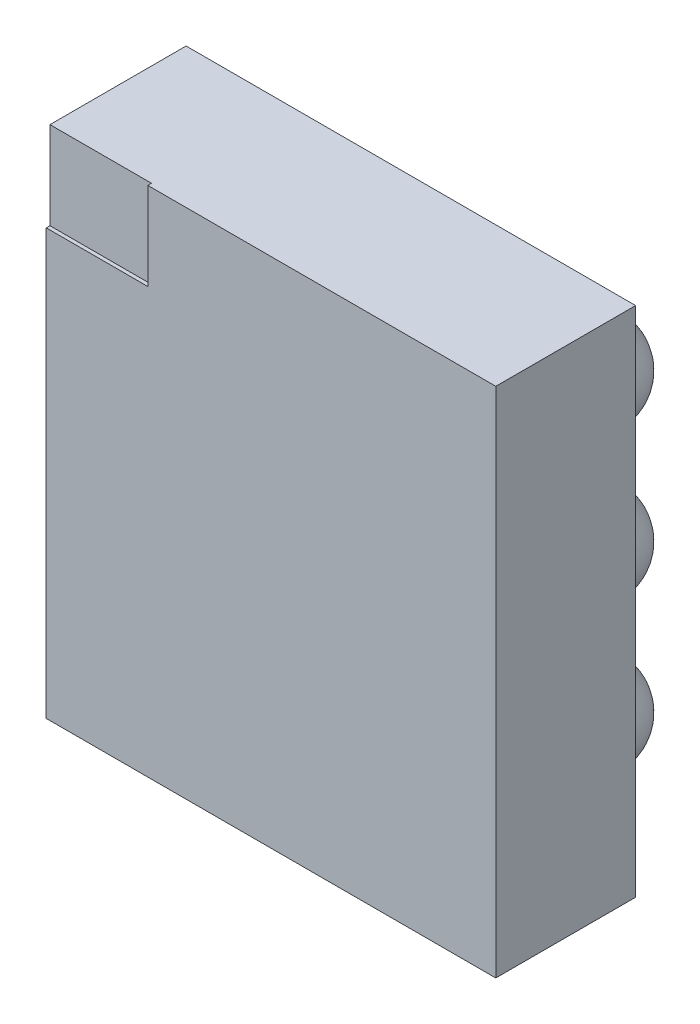
ISO-10303-21;
HEADER;
FILE_DESCRIPTION(('STEP AP214'),'2;1');
FILE_NAME('part.step','',(''),(''),'','','');
FILE_SCHEMA(('AUTOMOTIVE_DESIGN { 1 0 10303 214 1 1 1 1 }'));
ENDSEC;
DATA;
#1=APPLICATION_CONTEXT('core data for automotive mechanical design processes');
#2=APPLICATION_PROTOCOL_DEFINITION('international standard','automotive_design',2000,#1);
#3=PRODUCT_CONTEXT('',#1,'mechanical');
#4=PRODUCT('Part','Part','',(#3));
#5=PRODUCT_RELATED_PRODUCT_CATEGORY('part','',(#4));
#6=PRODUCT_DEFINITION_FORMATION('','',#4);
#7=PRODUCT_DEFINITION_CONTEXT('part definition',#1,'design');
#8=PRODUCT_DEFINITION('design','',#6,#7);
#9=PRODUCT_DEFINITION_SHAPE('','',#8);
#10=(LENGTH_UNIT() NAMED_UNIT(*) SI_UNIT(.MILLI.,.METRE.));
#11=(NAMED_UNIT(*) PLANE_ANGLE_UNIT() SI_UNIT($,.RADIAN.));
#12=(NAMED_UNIT(*) SI_UNIT($,.STERADIAN.) SOLID_ANGLE_UNIT());
#13=UNCERTAINTY_MEASURE_WITH_UNIT(LENGTH_MEASURE(1.E-05),#10,'distance_accuracy_value','');
#14=(GEOMETRIC_REPRESENTATION_CONTEXT(3) GLOBAL_UNCERTAINTY_ASSIGNED_CONTEXT((#13)) GLOBAL_UNIT_ASSIGNED_CONTEXT((#10,
#11,#12)) REPRESENTATION_CONTEXT('',''));
#15=CARTESIAN_POINT('',(0.,0.,0.));
#16=DIRECTION('',(0.,0.,1.));
#17=DIRECTION('',(1.,0.,0.));
#18=AXIS2_PLACEMENT_3D('',#15,#16,#17);
#19=CARTESIAN_POINT('',(0.4,-0.4,0.13));
#20=DIRECTION('',(0.,0.,1.));
#21=DIRECTION('',(0.,-1.,0.));
#22=AXIS2_PLACEMENT_3D('',#19,#20,#21);
#23=SPHERICAL_SURFACE('',#22,0.13);
#24=CARTESIAN_POINT('',(0.4,-0.4,0.203));
#25=DIRECTION('',(0.,0.,-1.));
#26=DIRECTION('',(-1.,0.,0.));
#27=AXIS2_PLACEMENT_3D('',#24,#25,#26);
#28=CIRCLE('',#27,0.107568582773968);
#29=CARTESIAN_POINT('',(0.292431417226032,-0.4,0.203));
#30=VERTEX_POINT('',#29);
#31=EDGE_CURVE('E11',#30,#30,#28,.T.);
#32=ORIENTED_EDGE('',*,*,#31,.T.);
#33=EDGE_LOOP('',(#32));
#34=FACE_BOUND('',#33,.T.);
#35=ADVANCED_FACE('F39',(#34),#23,.T.);
#36=CARTESIAN_POINT('',(0.,-0.4,0.13));
#37=DIRECTION('',(0.,0.,1.));
#38=DIRECTION('',(0.,-1.,0.));
#39=AXIS2_PLACEMENT_3D('',#36,#37,#38);
#40=SPHERICAL_SURFACE('',#39,0.13);
#41=CARTESIAN_POINT('',(0.,-0.4,0.203));
#42=DIRECTION('',(0.,0.,-1.));
#43=DIRECTION('',(-1.,0.,0.));
#44=AXIS2_PLACEMENT_3D('',#41,#42,#43);
#45=CIRCLE('',#44,0.107568582773968);
#46=CARTESIAN_POINT('',(-0.107568582773968,-0.4,0.203));
#47=VERTEX_POINT('',#46);
#48=EDGE_CURVE('E46',#47,#47,#45,.T.);
#49=ORIENTED_EDGE('',*,*,#48,.T.);
#50=EDGE_LOOP('',(#49));
#51=FACE_BOUND('',#50,.T.);
#52=ADVANCED_FACE('F180',(#51),#40,.T.);
#53=CARTESIAN_POINT('',(-0.4,-0.4,0.13));
#54=DIRECTION('',(0.,0.,1.));
#55=DIRECTION('',(0.,-1.,0.));
#56=AXIS2_PLACEMENT_3D('',#53,#54,#55);
#57=SPHERICAL_SURFACE('',#56,0.13);
#58=CARTESIAN_POINT('',(-0.4,-0.4,0.203));
#59=DIRECTION('',(0.,0.,-1.));
#60=DIRECTION('',(-1.,0.,0.));
#61=AXIS2_PLACEMENT_3D('',#58,#59,#60);
#62=CIRCLE('',#61,0.107568582773968);
#63=CARTESIAN_POINT('',(-0.507568582773968,-0.4,0.203));
#64=VERTEX_POINT('',#63);
#65=EDGE_CURVE('E175',#64,#64,#62,.T.);
#66=ORIENTED_EDGE('',*,*,#65,.T.);
#67=EDGE_LOOP('',(#66));
#68=FACE_BOUND('',#67,.T.);
#69=ADVANCED_FACE('F225',(#68),#57,.T.);
#70=CARTESIAN_POINT('',(0.4,0.,0.13));
#71=DIRECTION('',(0.,0.,1.));
#72=DIRECTION('',(0.,-1.,0.));
#73=AXIS2_PLACEMENT_3D('',#70,#71,#72);
#74=SPHERICAL_SURFACE('',#73,0.13);
#75=CARTESIAN_POINT('',(0.4,0.,0.203));
#76=DIRECTION('',(0.,0.,-1.));
#77=DIRECTION('',(-1.,0.,0.));
#78=AXIS2_PLACEMENT_3D('',#75,#76,#77);
#79=CIRCLE('',#78,0.107568582773968);
#80=CARTESIAN_POINT('',(0.292431417226032,0.,0.203));
#81=VERTEX_POINT('',#80);
#82=EDGE_CURVE('E172',#81,#81,#79,.T.);
#83=ORIENTED_EDGE('',*,*,#82,.T.);
#84=EDGE_LOOP('',(#83));
#85=FACE_BOUND('',#84,.T.);
#86=ADVANCED_FACE('F230',(#85),#74,.T.);
#87=CARTESIAN_POINT('',(0.4,0.4,0.13));
#88=DIRECTION('',(0.,0.,1.));
#89=DIRECTION('',(0.,-1.,0.));
#90=AXIS2_PLACEMENT_3D('',#87,#88,#89);
#91=SPHERICAL_SURFACE('',#90,0.13);
#92=CARTESIAN_POINT('',(0.4,0.4,0.203));
#93=DIRECTION('',(0.,0.,-1.));
#94=DIRECTION('',(-1.,0.,0.));
#95=AXIS2_PLACEMENT_3D('',#92,#93,#94);
#96=CIRCLE('',#95,0.107568582773968);
#97=CARTESIAN_POINT('',(0.292431417226032,0.4,0.203));
#98=VERTEX_POINT('',#97);
#99=EDGE_CURVE('E169',#98,#98,#96,.T.);
#100=ORIENTED_EDGE('',*,*,#99,.T.);
#101=EDGE_LOOP('',(#100));
#102=FACE_BOUND('',#101,.T.);
#103=ADVANCED_FACE('F236',(#102),#91,.T.);
#104=CARTESIAN_POINT('',(-0.4,0.4,0.13));
#105=DIRECTION('',(0.,0.,1.));
#106=DIRECTION('',(0.,-1.,0.));
#107=AXIS2_PLACEMENT_3D('',#104,#105,#106);
#108=SPHERICAL_SURFACE('',#107,0.13);
#109=CARTESIAN_POINT('',(-0.4,0.4,0.203));
#110=DIRECTION('',(0.,0.,-1.));
#111=DIRECTION('',(-1.,0.,0.));
#112=AXIS2_PLACEMENT_3D('',#109,#110,#111);
#113=CIRCLE('',#112,0.107568582773968);
#114=CARTESIAN_POINT('',(-0.507568582773968,0.4,0.203));
#115=VERTEX_POINT('',#114);
#116=EDGE_CURVE('E166',#115,#115,#113,.T.);
#117=ORIENTED_EDGE('',*,*,#116,.T.);
#118=EDGE_LOOP('',(#117));
#119=FACE_BOUND('',#118,.T.);
#120=ADVANCED_FACE('F240',(#119),#108,.T.);
#121=CARTESIAN_POINT('',(-0.4,0.,0.13));
#122=DIRECTION('',(0.,0.,1.));
#123=DIRECTION('',(0.,-1.,0.));
#124=AXIS2_PLACEMENT_3D('',#121,#122,#123);
#125=SPHERICAL_SURFACE('',#124,0.13);
#126=CARTESIAN_POINT('',(-0.4,0.,0.203));
#127=DIRECTION('',(0.,0.,-1.));
#128=DIRECTION('',(-1.,0.,0.));
#129=AXIS2_PLACEMENT_3D('',#126,#127,#128);
#130=CIRCLE('',#129,0.107568582773968);
#131=CARTESIAN_POINT('',(-0.507568582773968,0.,0.203));
#132=VERTEX_POINT('',#131);
#133=EDGE_CURVE('E163',#132,#132,#130,.T.);
#134=ORIENTED_EDGE('',*,*,#133,.T.);
#135=EDGE_LOOP('',(#134));
#136=FACE_BOUND('',#135,.T.);
#137=ADVANCED_FACE('F244',(#136),#125,.T.);
#138=CARTESIAN_POINT('',(0.,0.4,0.13));
#139=DIRECTION('',(0.,0.,1.));
#140=DIRECTION('',(0.,-1.,0.));
#141=AXIS2_PLACEMENT_3D('',#138,#139,#140);
#142=SPHERICAL_SURFACE('',#141,0.13);
#143=CARTESIAN_POINT('',(0.,0.4,0.203));
#144=DIRECTION('',(0.,0.,-1.));
#145=DIRECTION('',(-1.,0.,0.));
#146=AXIS2_PLACEMENT_3D('',#143,#144,#145);
#147=CIRCLE('',#146,0.107568582773968);
#148=CARTESIAN_POINT('',(-0.107568582773968,0.4,0.203));
#149=VERTEX_POINT('',#148);
#150=EDGE_CURVE('E160',#149,#149,#147,.T.);
#151=ORIENTED_EDGE('',*,*,#150,.T.);
#152=EDGE_LOOP('',(#151));
#153=FACE_BOUND('',#152,.T.);
#154=ADVANCED_FACE('F218',(#153),#142,.T.);
#155=CARTESIAN_POINT('',(0.6075,-0.6925,0.581));
#156=DIRECTION('',(-1.,0.,0.));
#157=DIRECTION('',(0.,0.,1.));
#158=AXIS2_PLACEMENT_3D('',#155,#156,#157);
#159=PLANE('',#158);
#160=DIRECTION('',(0.,1.,0.));
#161=VECTOR('',#160,1.);
#162=CARTESIAN_POINT('',(0.6075,-0.6925,0.203));
#163=LINE('',#162,#161);
#164=CARTESIAN_POINT('',(0.6075,-0.6925,0.203));
#165=VERTEX_POINT('',#164);
#166=CARTESIAN_POINT('',(0.6075,0.6925,0.203));
#167=VERTEX_POINT('',#166);
#168=EDGE_CURVE('E141',#165,#167,#163,.T.);
#169=ORIENTED_EDGE('',*,*,#168,.T.);
#170=DIRECTION('',(0.,0.,-1.));
#171=VECTOR('',#170,1.);
#172=CARTESIAN_POINT('',(0.6075,0.6925,0.581));
#173=LINE('',#172,#171);
#174=CARTESIAN_POINT('',(0.6075,0.6925,0.581));
#175=VERTEX_POINT('',#174);
#176=EDGE_CURVE('E155',#175,#167,#173,.T.);
#177=ORIENTED_EDGE('',*,*,#176,.F.);
#178=DIRECTION('',(0.,1.,0.));
#179=VECTOR('',#178,1.);
#180=CARTESIAN_POINT('',(0.6075,-0.6925,0.581));
#181=LINE('',#180,#179);
#182=CARTESIAN_POINT('',(0.6075,-0.6925,0.581));
#183=VERTEX_POINT('',#182);
#184=EDGE_CURVE('E135',#183,#175,#181,.T.);
#185=ORIENTED_EDGE('',*,*,#184,.F.);
#186=DIRECTION('',(0.,0.,-1.));
#187=VECTOR('',#186,1.);
#188=CARTESIAN_POINT('',(0.6075,-0.6925,0.581));
#189=LINE('',#188,#187);
#190=EDGE_CURVE('E140',#183,#165,#189,.T.);
#191=ORIENTED_EDGE('',*,*,#190,.T.);
#192=EDGE_LOOP('',(#169,#177,#185,#191));
#193=FACE_BOUND('',#192,.T.);
#194=ADVANCED_FACE('F207',(#193),#159,.F.);
#195=CARTESIAN_POINT('',(-0.6075,0.6925,0.581));
#196=DIRECTION('',(0.,-1.,0.));
#197=DIRECTION('',(0.,0.,-1.));
#198=AXIS2_PLACEMENT_3D('',#195,#196,#197);
#199=PLANE('',#198);
#200=DIRECTION('',(-1.,0.,0.));
#201=VECTOR('',#200,1.);
#202=CARTESIAN_POINT('',(-0.6075,0.6925,0.571));
#203=LINE('',#202,#201);
#204=CARTESIAN_POINT('',(-0.333122882557599,0.6925,0.571));
#205=VERTEX_POINT('',#204);
#206=CARTESIAN_POINT('',(-0.6075,0.6925,0.571));
#207=VERTEX_POINT('',#206);
#208=EDGE_CURVE('E120',#205,#207,#203,.T.);
#209=ORIENTED_EDGE('',*,*,#208,.F.);
#210=DIRECTION('',(0.,0.,1.));
#211=VECTOR('',#210,1.);
#212=CARTESIAN_POINT('',(-0.333122882557599,0.6925,0.571));
#213=LINE('',#212,#211);
#214=CARTESIAN_POINT('',(-0.333122882557599,0.6925,0.581));
#215=VERTEX_POINT('',#214);
#216=EDGE_CURVE('E130',#205,#215,#213,.T.);
#217=ORIENTED_EDGE('',*,*,#216,.T.);
#218=DIRECTION('',(-1.,0.,0.));
#219=VECTOR('',#218,1.);
#220=CARTESIAN_POINT('',(-0.6075,0.6925,0.581));
#221=LINE('',#220,#219);
#222=EDGE_CURVE('E89',#175,#215,#221,.T.);
#223=ORIENTED_EDGE('',*,*,#222,.F.);
#224=ORIENTED_EDGE('',*,*,#176,.T.);
#225=DIRECTION('',(-1.,0.,0.));
#226=VECTOR('',#225,1.);
#227=CARTESIAN_POINT('',(-0.6075,0.6925,0.203));
#228=LINE('',#227,#226);
#229=CARTESIAN_POINT('',(-0.6075,0.6925,0.203));
#230=VERTEX_POINT('',#229);
#231=EDGE_CURVE('E144',#167,#230,#228,.T.);
#232=ORIENTED_EDGE('',*,*,#231,.T.);
#233=DIRECTION('',(0.,0.,-1.));
#234=VECTOR('',#233,1.);
#235=CARTESIAN_POINT('',(-0.6075,0.6925,0.581));
#236=LINE('',#235,#234);
#237=EDGE_CURVE('E153',#207,#230,#236,.T.);
#238=ORIENTED_EDGE('',*,*,#237,.F.);
#239=EDGE_LOOP('',(#209,#217,#223,#224,#232,#238));
#240=FACE_BOUND('',#239,.T.);
#241=ADVANCED_FACE('F210',(#240),#199,.F.);
#242=CARTESIAN_POINT('',(-0.6075,-0.6925,0.581));
#243=DIRECTION('',(1.,0.,0.));
#244=DIRECTION('',(0.,0.,-1.));
#245=AXIS2_PLACEMENT_3D('',#242,#243,#244);
#246=PLANE('',#245);
#247=DIRECTION('',(0.,-1.,0.));
#248=VECTOR('',#247,1.);
#249=CARTESIAN_POINT('',(-0.6075,-0.6925,0.581));
#250=LINE('',#249,#248);
#251=CARTESIAN_POINT('',(-0.6075,0.455874476514181,0.581));
#252=VERTEX_POINT('',#251);
#253=CARTESIAN_POINT('',(-0.6075,-0.6925,0.581));
#254=VERTEX_POINT('',#253);
#255=EDGE_CURVE('E128',#252,#254,#250,.T.);
#256=ORIENTED_EDGE('',*,*,#255,.F.);
#257=DIRECTION('',(0.,0.,1.));
#258=VECTOR('',#257,1.);
#259=CARTESIAN_POINT('',(-0.6075,0.455874476514181,0.571));
#260=LINE('',#259,#258);
#261=CARTESIAN_POINT('',(-0.6075,0.455874476514181,0.571));
#262=VERTEX_POINT('',#261);
#263=EDGE_CURVE('E53',#262,#252,#260,.T.);
#264=ORIENTED_EDGE('',*,*,#263,.F.);
#265=DIRECTION('',(0.,-1.,0.));
#266=VECTOR('',#265,1.);
#267=CARTESIAN_POINT('',(-0.6075,0.6925,0.571));
#268=LINE('',#267,#266);
#269=EDGE_CURVE('E115',#207,#262,#268,.T.);
#270=ORIENTED_EDGE('',*,*,#269,.F.);
#271=ORIENTED_EDGE('',*,*,#237,.T.);
#272=DIRECTION('',(0.,-1.,0.));
#273=VECTOR('',#272,1.);
#274=CARTESIAN_POINT('',(-0.6075,-0.6925,0.203));
#275=LINE('',#274,#273);
#276=CARTESIAN_POINT('',(-0.6075,-0.6925,0.203));
#277=VERTEX_POINT('',#276);
#278=EDGE_CURVE('E147',#230,#277,#275,.T.);
#279=ORIENTED_EDGE('',*,*,#278,.T.);
#280=DIRECTION('',(0.,0.,-1.));
#281=VECTOR('',#280,1.);
#282=CARTESIAN_POINT('',(-0.6075,-0.6925,0.581));
#283=LINE('',#282,#281);
#284=EDGE_CURVE('E151',#254,#277,#283,.T.);
#285=ORIENTED_EDGE('',*,*,#284,.F.);
#286=EDGE_LOOP('',(#256,#264,#270,#271,#279,#285));
#287=FACE_BOUND('',#286,.T.);
#288=ADVANCED_FACE('F126',(#287),#246,.F.);
#289=CARTESIAN_POINT('',(-0.6075,-0.6925,0.581));
#290=DIRECTION('',(0.,1.,0.));
#291=DIRECTION('',(0.,0.,1.));
#292=AXIS2_PLACEMENT_3D('',#289,#290,#291);
#293=PLANE('',#292);
#294=DIRECTION('',(1.,0.,0.));
#295=VECTOR('',#294,1.);
#296=CARTESIAN_POINT('',(-0.6075,-0.6925,0.203));
#297=LINE('',#296,#295);
#298=EDGE_CURVE('E82',#277,#165,#297,.T.);
#299=ORIENTED_EDGE('',*,*,#298,.T.);
#300=ORIENTED_EDGE('',*,*,#190,.F.);
#301=DIRECTION('',(1.,0.,0.));
#302=VECTOR('',#301,1.);
#303=CARTESIAN_POINT('',(-0.6075,-0.6925,0.581));
#304=LINE('',#303,#302);
#305=EDGE_CURVE('E62',#254,#183,#304,.T.);
#306=ORIENTED_EDGE('',*,*,#305,.F.);
#307=ORIENTED_EDGE('',*,*,#284,.T.);
#308=EDGE_LOOP('',(#299,#300,#306,#307));
#309=FACE_BOUND('',#308,.T.);
#310=ADVANCED_FACE('F209',(#309),#293,.F.);
#311=CARTESIAN_POINT('',(0.,0.,0.581));
#312=DIRECTION('',(0.,0.,-1.));
#313=DIRECTION('',(-1.,0.,0.));
#314=AXIS2_PLACEMENT_3D('',#311,#312,#313);
#315=PLANE('',#314);
#316=ORIENTED_EDGE('',*,*,#222,.T.);
#317=DIRECTION('',(0.,1.,0.));
#318=VECTOR('',#317,1.);
#319=CARTESIAN_POINT('',(-0.333122882557599,0.6925,0.581));
#320=LINE('',#319,#318);
#321=CARTESIAN_POINT('',(-0.333122882557599,0.455874476514181,0.581));
#322=VERTEX_POINT('',#321);
#323=EDGE_CURVE('E123',#322,#215,#320,.T.);
#324=ORIENTED_EDGE('',*,*,#323,.F.);
#325=DIRECTION('',(1.,0.,0.));
#326=VECTOR('',#325,1.);
#327=CARTESIAN_POINT('',(-0.6075,0.455874476514181,0.581));
#328=LINE('',#327,#326);
#329=EDGE_CURVE('E421',#252,#322,#328,.T.);
#330=ORIENTED_EDGE('',*,*,#329,.F.);
#331=ORIENTED_EDGE('',*,*,#255,.T.);
#332=ORIENTED_EDGE('',*,*,#305,.T.);
#333=ORIENTED_EDGE('',*,*,#184,.T.);
#334=EDGE_LOOP('',(#316,#324,#330,#331,#332,#333));
#335=FACE_BOUND('',#334,.T.);
#336=ADVANCED_FACE('F186',(#335),#315,.F.);
#337=CARTESIAN_POINT('',(0.,0.,0.203));
#338=DIRECTION('',(0.,0.,-1.));
#339=DIRECTION('',(-1.,0.,0.));
#340=AXIS2_PLACEMENT_3D('',#337,#338,#339);
#341=PLANE('',#340);
#342=ORIENTED_EDGE('',*,*,#31,.F.);
#343=EDGE_LOOP('',(#342));
#344=FACE_BOUND('',#343,.T.);
#345=ORIENTED_EDGE('',*,*,#48,.F.);
#346=EDGE_LOOP('',(#345));
#347=FACE_BOUND('',#346,.T.);
#348=ORIENTED_EDGE('',*,*,#65,.F.);
#349=EDGE_LOOP('',(#348));
#350=FACE_BOUND('',#349,.T.);
#351=ORIENTED_EDGE('',*,*,#82,.F.);
#352=EDGE_LOOP('',(#351));
#353=FACE_BOUND('',#352,.T.);
#354=ORIENTED_EDGE('',*,*,#99,.F.);
#355=EDGE_LOOP('',(#354));
#356=FACE_BOUND('',#355,.T.);
#357=ORIENTED_EDGE('',*,*,#116,.F.);
#358=EDGE_LOOP('',(#357));
#359=FACE_BOUND('',#358,.T.);
#360=ORIENTED_EDGE('',*,*,#133,.F.);
#361=EDGE_LOOP('',(#360));
#362=FACE_BOUND('',#361,.T.);
#363=ORIENTED_EDGE('',*,*,#150,.F.);
#364=EDGE_LOOP('',(#363));
#365=FACE_BOUND('',#364,.T.);
#366=CARTESIAN_POINT('',(0.,0.,0.203));
#367=DIRECTION('',(0.,0.,-1.));
#368=DIRECTION('',(-1.,0.,0.));
#369=AXIS2_PLACEMENT_3D('',#366,#367,#368);
#370=CIRCLE('',#369,0.107568582773968);
#371=CARTESIAN_POINT('',(-0.107568582773968,0.,0.203));
#372=VERTEX_POINT('',#371);
#373=EDGE_CURVE('E157',#372,#372,#370,.T.);
#374=ORIENTED_EDGE('',*,*,#373,.F.);
#375=EDGE_LOOP('',(#374));
#376=FACE_BOUND('',#375,.T.);
#377=ORIENTED_EDGE('',*,*,#168,.F.);
#378=ORIENTED_EDGE('',*,*,#298,.F.);
#379=ORIENTED_EDGE('',*,*,#278,.F.);
#380=ORIENTED_EDGE('',*,*,#231,.F.);
#381=EDGE_LOOP('',(#377,#378,#379,#380));
#382=FACE_BOUND('',#381,.T.);
#383=ADVANCED_FACE('F182',(#344,#347,#350,#353,#356,#359,#362,#365,#376,#382),#341,.T.);
#384=CARTESIAN_POINT('',(-0.333122882557599,0.6925,0.571));
#385=DIRECTION('',(1.,0.,0.));
#386=DIRECTION('',(0.,0.,-1.));
#387=AXIS2_PLACEMENT_3D('',#384,#385,#386);
#388=PLANE('',#387);
#389=ORIENTED_EDGE('',*,*,#323,.T.);
#390=ORIENTED_EDGE('',*,*,#216,.F.);
#391=DIRECTION('',(0.,1.,0.));
#392=VECTOR('',#391,1.);
#393=CARTESIAN_POINT('',(-0.333122882557599,0.6925,0.571));
#394=LINE('',#393,#392);
#395=CARTESIAN_POINT('',(-0.333122882557599,0.455874476514181,0.571));
#396=VERTEX_POINT('',#395);
#397=EDGE_CURVE('E114',#396,#205,#394,.T.);
#398=ORIENTED_EDGE('',*,*,#397,.F.);
#399=DIRECTION('',(0.,0.,1.));
#400=VECTOR('',#399,1.);
#401=CARTESIAN_POINT('',(-0.333122882557599,0.455874476514181,0.571));
#402=LINE('',#401,#400);
#403=EDGE_CURVE('E110',#396,#322,#402,.T.);
#404=ORIENTED_EDGE('',*,*,#403,.T.);
#405=EDGE_LOOP('',(#389,#390,#398,#404));
#406=FACE_BOUND('',#405,.T.);
#407=ADVANCED_FACE('F185',(#406),#388,.F.);
#408=CARTESIAN_POINT('',(-0.6075,0.455874476514181,0.571));
#409=DIRECTION('',(0.,-1.,0.));
#410=DIRECTION('',(0.,0.,-1.));
#411=AXIS2_PLACEMENT_3D('',#408,#409,#410);
#412=PLANE('',#411);
#413=ORIENTED_EDGE('',*,*,#329,.T.);
#414=ORIENTED_EDGE('',*,*,#403,.F.);
#415=DIRECTION('',(1.,0.,0.));
#416=VECTOR('',#415,1.);
#417=CARTESIAN_POINT('',(-0.6075,0.455874476514181,0.571));
#418=LINE('',#417,#416);
#419=EDGE_CURVE('E107',#262,#396,#418,.T.);
#420=ORIENTED_EDGE('',*,*,#419,.F.);
#421=ORIENTED_EDGE('',*,*,#263,.T.);
#422=EDGE_LOOP('',(#413,#414,#420,#421));
#423=FACE_BOUND('',#422,.T.);
#424=ADVANCED_FACE('F109',(#423),#412,.F.);
#425=CARTESIAN_POINT('',(0.,0.,0.571));
#426=DIRECTION('',(0.,0.,1.));
#427=DIRECTION('',(1.,0.,0.));
#428=AXIS2_PLACEMENT_3D('',#425,#426,#427);
#429=PLANE('',#428);
#430=ORIENTED_EDGE('',*,*,#269,.T.);
#431=ORIENTED_EDGE('',*,*,#419,.T.);
#432=ORIENTED_EDGE('',*,*,#397,.T.);
#433=ORIENTED_EDGE('',*,*,#208,.T.);
#434=EDGE_LOOP('',(#430,#431,#432,#433));
#435=FACE_BOUND('',#434,.T.);
#436=ADVANCED_FACE('F118',(#435),#429,.T.);
#437=CARTESIAN_POINT('',(0.,0.,0.13));
#438=DIRECTION('',(0.,0.,1.));
#439=DIRECTION('',(0.,-1.,0.));
#440=AXIS2_PLACEMENT_3D('',#437,#438,#439);
#441=SPHERICAL_SURFACE('',#440,0.13);
#442=ORIENTED_EDGE('',*,*,#373,.T.);
#443=EDGE_LOOP('',(#442));
#444=FACE_BOUND('',#443,.T.);
#445=ADVANCED_FACE('F319',(#444),#441,.T.);
#446=CLOSED_SHELL('',(#35,#52,#69,#86,#103,#120,#137,#154,#194,#241,#288,#310,#336,#383,#407,
#424,#436,#445));
#447=MANIFOLD_SOLID_BREP('B2',#446);
#448=ADVANCED_BREP_SHAPE_REPRESENTATION('',(#18,#447),#14);
#449=SHAPE_DEFINITION_REPRESENTATION(#9,#448);
ENDSEC;
END-ISO-10303-21;
